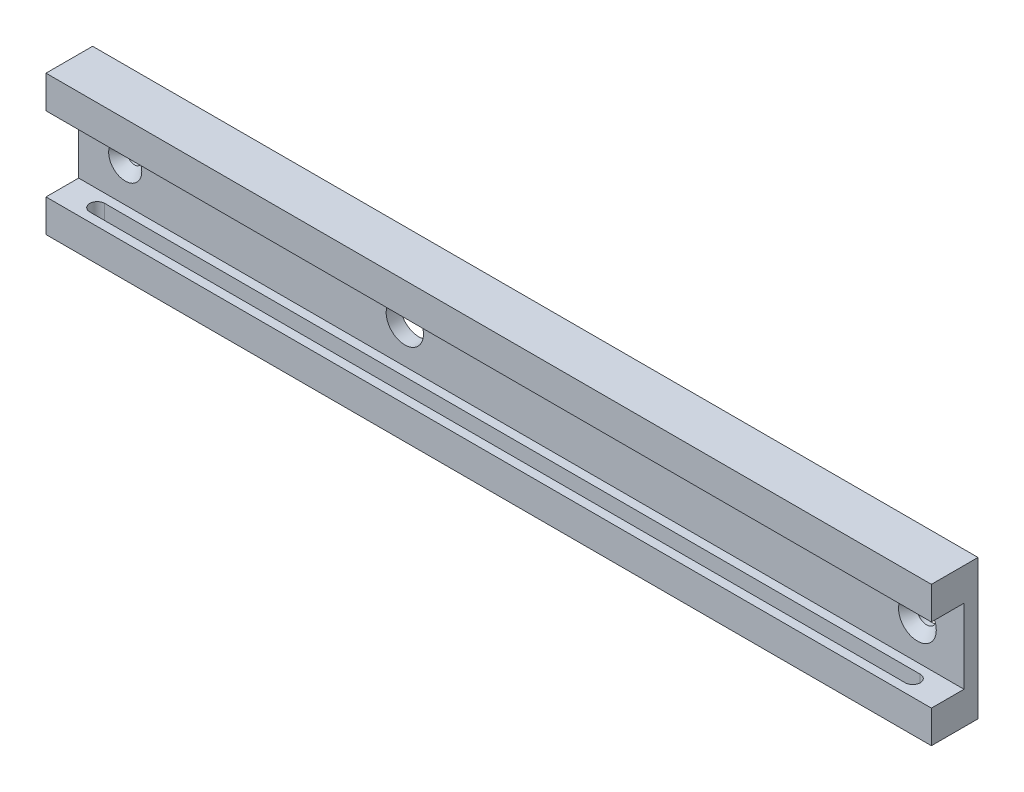
ISO-10303-21;
HEADER;
FILE_DESCRIPTION(('STEP AP214'),'2;1');
FILE_NAME('part.step','',(''),(''),'','','');
FILE_SCHEMA(('AUTOMOTIVE_DESIGN { 1 0 10303 214 1 1 1 1 }'));
ENDSEC;
DATA;
#1=APPLICATION_CONTEXT('core data for automotive mechanical design processes');
#2=APPLICATION_PROTOCOL_DEFINITION('international standard','automotive_design',2000,#1);
#3=PRODUCT_CONTEXT('',#1,'mechanical');
#4=PRODUCT('Part','Part','',(#3));
#5=PRODUCT_RELATED_PRODUCT_CATEGORY('part','',(#4));
#6=PRODUCT_DEFINITION_FORMATION('','',#4);
#7=PRODUCT_DEFINITION_CONTEXT('part definition',#1,'design');
#8=PRODUCT_DEFINITION('design','',#6,#7);
#9=PRODUCT_DEFINITION_SHAPE('','',#8);
#10=(LENGTH_UNIT() NAMED_UNIT(*) SI_UNIT(.MILLI.,.METRE.));
#11=(NAMED_UNIT(*) PLANE_ANGLE_UNIT() SI_UNIT($,.RADIAN.));
#12=(NAMED_UNIT(*) SI_UNIT($,.STERADIAN.) SOLID_ANGLE_UNIT());
#13=UNCERTAINTY_MEASURE_WITH_UNIT(LENGTH_MEASURE(1.E-05),#10,'distance_accuracy_value','');
#14=(GEOMETRIC_REPRESENTATION_CONTEXT(3) GLOBAL_UNCERTAINTY_ASSIGNED_CONTEXT((#13)) GLOBAL_UNIT_ASSIGNED_CONTEXT((#10,
#11,#12)) REPRESENTATION_CONTEXT('',''));
#15=CARTESIAN_POINT('',(0.,0.,0.));
#16=DIRECTION('',(0.,0.,1.));
#17=DIRECTION('',(1.,0.,0.));
#18=AXIS2_PLACEMENT_3D('',#15,#16,#17);
#19=CARTESIAN_POINT('',(0.,0.,10.));
#20=DIRECTION('',(0.,0.,-1.));
#21=DIRECTION('',(-1.,0.,0.));
#22=AXIS2_PLACEMENT_3D('',#19,#20,#21);
#23=PLANE('',#22);
#24=DIRECTION('',(0.,-1.,0.));
#25=VECTOR('',#24,1.);
#26=CARTESIAN_POINT('',(0.,0.,10.));
#27=LINE('',#26,#25);
#28=CARTESIAN_POINT('',(0.,30.,10.));
#29=VERTEX_POINT('',#28);
#30=CARTESIAN_POINT('',(0.,23.,10.));
#31=VERTEX_POINT('',#30);
#32=EDGE_CURVE('E181',#29,#31,#27,.T.);
#33=ORIENTED_EDGE('',*,*,#32,.T.);
#34=DIRECTION('',(1.,0.,0.));
#35=VECTOR('',#34,1.);
#36=CARTESIAN_POINT('',(0.,23.,10.));
#37=LINE('',#36,#35);
#38=CARTESIAN_POINT('',(190.,23.,10.));
#39=VERTEX_POINT('',#38);
#40=EDGE_CURVE('E172',#31,#39,#37,.T.);
#41=ORIENTED_EDGE('',*,*,#40,.T.);
#42=DIRECTION('',(0.,1.,0.));
#43=VECTOR('',#42,1.);
#44=CARTESIAN_POINT('',(190.,0.,10.));
#45=LINE('',#44,#43);
#46=CARTESIAN_POINT('',(190.,30.,10.));
#47=VERTEX_POINT('',#46);
#48=EDGE_CURVE('E187',#39,#47,#45,.T.);
#49=ORIENTED_EDGE('',*,*,#48,.T.);
#50=DIRECTION('',(-1.,0.,0.));
#51=VECTOR('',#50,1.);
#52=CARTESIAN_POINT('',(0.,30.,10.));
#53=LINE('',#52,#51);
#54=EDGE_CURVE('E191',#47,#29,#53,.T.);
#55=ORIENTED_EDGE('',*,*,#54,.T.);
#56=EDGE_LOOP('',(#33,#41,#49,#55));
#57=FACE_BOUND('',#56,.T.);
#58=ADVANCED_FACE('F37',(#57),#23,.F.);
#59=CARTESIAN_POINT('',(0.,0.,10.));
#60=DIRECTION('',(1.,0.,0.));
#61=DIRECTION('',(0.,0.,-1.));
#62=AXIS2_PLACEMENT_3D('',#59,#60,#61);
#63=PLANE('',#62);
#64=DIRECTION('',(0.,1.,0.));
#65=VECTOR('',#64,1.);
#66=CARTESIAN_POINT('',(0.,7.,3.));
#67=LINE('',#66,#65);
#68=CARTESIAN_POINT('',(0.,7.,3.));
#69=VERTEX_POINT('',#68);
#70=CARTESIAN_POINT('',(0.,23.,3.));
#71=VERTEX_POINT('',#70);
#72=EDGE_CURVE('E158',#69,#71,#67,.T.);
#73=ORIENTED_EDGE('',*,*,#72,.T.);
#74=DIRECTION('',(0.,0.,1.));
#75=VECTOR('',#74,1.);
#76=CARTESIAN_POINT('',(0.,23.,10.));
#77=LINE('',#76,#75);
#78=EDGE_CURVE('E162',#71,#31,#77,.T.);
#79=ORIENTED_EDGE('',*,*,#78,.T.);
#80=ORIENTED_EDGE('',*,*,#32,.F.);
#81=DIRECTION('',(0.,0.,-1.));
#82=VECTOR('',#81,1.);
#83=CARTESIAN_POINT('',(0.,30.,10.));
#84=LINE('',#83,#82);
#85=CARTESIAN_POINT('',(0.,30.,0.));
#86=VERTEX_POINT('',#85);
#87=EDGE_CURVE('E193',#29,#86,#84,.T.);
#88=ORIENTED_EDGE('',*,*,#87,.T.);
#89=DIRECTION('',(0.,-1.,0.));
#90=VECTOR('',#89,1.);
#91=CARTESIAN_POINT('',(0.,0.,0.));
#92=LINE('',#91,#90);
#93=CARTESIAN_POINT('',(0.,0.,0.));
#94=VERTEX_POINT('',#93);
#95=EDGE_CURVE('E175',#86,#94,#92,.T.);
#96=ORIENTED_EDGE('',*,*,#95,.T.);
#97=DIRECTION('',(0.,0.,-1.));
#98=VECTOR('',#97,1.);
#99=CARTESIAN_POINT('',(0.,0.,10.));
#100=LINE('',#99,#98);
#101=CARTESIAN_POINT('',(0.,0.,10.));
#102=VERTEX_POINT('',#101);
#103=EDGE_CURVE('E210',#102,#94,#100,.T.);
#104=ORIENTED_EDGE('',*,*,#103,.F.);
#105=CARTESIAN_POINT('',(0.,7.,10.));
#106=VERTEX_POINT('',#105);
#107=EDGE_CURVE('E185',#106,#102,#27,.T.);
#108=ORIENTED_EDGE('',*,*,#107,.F.);
#109=DIRECTION('',(0.,0.,-1.));
#110=VECTOR('',#109,1.);
#111=CARTESIAN_POINT('',(0.,7.,10.));
#112=LINE('',#111,#110);
#113=EDGE_CURVE('E155',#106,#69,#112,.T.);
#114=ORIENTED_EDGE('',*,*,#113,.T.);
#115=EDGE_LOOP('',(#73,#79,#80,#88,#96,#104,#108,#114));
#116=FACE_BOUND('',#115,.T.);
#117=ADVANCED_FACE('F234',(#116),#63,.F.);
#118=CARTESIAN_POINT('',(0.,0.,10.));
#119=DIRECTION('',(0.,1.,0.));
#120=DIRECTION('',(0.,0.,1.));
#121=AXIS2_PLACEMENT_3D('',#118,#119,#120);
#122=PLANE('',#121);
#123=CARTESIAN_POINT('',(182.5,0.,6.50000000000001));
#124=DIRECTION('',(0.,-1.,0.));
#125=DIRECTION('',(0.,0.,-1.));
#126=AXIS2_PLACEMENT_3D('',#123,#124,#125);
#127=CIRCLE('',#126,1.6);
#128=CARTESIAN_POINT('',(182.5,0.,4.90000000000001));
#129=VERTEX_POINT('',#128);
#130=CARTESIAN_POINT('',(182.5,0.,8.10000000000001));
#131=VERTEX_POINT('',#130);
#132=EDGE_CURVE('E334',#129,#131,#127,.T.);
#133=ORIENTED_EDGE('',*,*,#132,.F.);
#134=DIRECTION('',(1.,0.,0.));
#135=VECTOR('',#134,1.);
#136=CARTESIAN_POINT('',(7.50000000000002,0.,4.9));
#137=LINE('',#136,#135);
#138=CARTESIAN_POINT('',(7.50000000000002,0.,4.9));
#139=VERTEX_POINT('',#138);
#140=EDGE_CURVE('E337',#139,#129,#137,.T.);
#141=ORIENTED_EDGE('',*,*,#140,.F.);
#142=CARTESIAN_POINT('',(7.50000000000002,0.,6.5));
#143=DIRECTION('',(0.,-1.,0.));
#144=DIRECTION('',(0.,0.,-1.));
#145=AXIS2_PLACEMENT_3D('',#142,#143,#144);
#146=CIRCLE('',#145,1.6);
#147=CARTESIAN_POINT('',(7.50000000000002,0.,8.1));
#148=VERTEX_POINT('',#147);
#149=EDGE_CURVE('E146',#148,#139,#146,.T.);
#150=ORIENTED_EDGE('',*,*,#149,.F.);
#151=DIRECTION('',(-1.,0.,0.));
#152=VECTOR('',#151,1.);
#153=CARTESIAN_POINT('',(7.50000000000002,0.,8.1));
#154=LINE('',#153,#152);
#155=EDGE_CURVE('E52',#131,#148,#154,.T.);
#156=ORIENTED_EDGE('',*,*,#155,.F.);
#157=EDGE_LOOP('',(#133,#141,#150,#156));
#158=FACE_BOUND('',#157,.T.);
#159=DIRECTION('',(1.,0.,0.));
#160=VECTOR('',#159,1.);
#161=CARTESIAN_POINT('',(0.,0.,0.));
#162=LINE('',#161,#160);
#163=CARTESIAN_POINT('',(190.,0.,0.));
#164=VERTEX_POINT('',#163);
#165=EDGE_CURVE('E196',#94,#164,#162,.T.);
#166=ORIENTED_EDGE('',*,*,#165,.T.);
#167=DIRECTION('',(0.,0.,-1.));
#168=VECTOR('',#167,1.);
#169=CARTESIAN_POINT('',(190.,0.,10.));
#170=LINE('',#169,#168);
#171=CARTESIAN_POINT('',(190.,0.,10.));
#172=VERTEX_POINT('',#171);
#173=EDGE_CURVE('E207',#172,#164,#170,.T.);
#174=ORIENTED_EDGE('',*,*,#173,.F.);
#175=DIRECTION('',(1.,0.,0.));
#176=VECTOR('',#175,1.);
#177=CARTESIAN_POINT('',(0.,0.,10.));
#178=LINE('',#177,#176);
#179=EDGE_CURVE('E184',#102,#172,#178,.T.);
#180=ORIENTED_EDGE('',*,*,#179,.F.);
#181=ORIENTED_EDGE('',*,*,#103,.T.);
#182=EDGE_LOOP('',(#166,#174,#180,#181));
#183=FACE_BOUND('',#182,.T.);
#184=ADVANCED_FACE('F241',(#158,#183),#122,.F.);
#185=CARTESIAN_POINT('',(190.,0.,10.));
#186=DIRECTION('',(-1.,0.,0.));
#187=DIRECTION('',(0.,0.,1.));
#188=AXIS2_PLACEMENT_3D('',#185,#186,#187);
#189=PLANE('',#188);
#190=ORIENTED_EDGE('',*,*,#48,.F.);
#191=DIRECTION('',(0.,0.,1.));
#192=VECTOR('',#191,1.);
#193=CARTESIAN_POINT('',(190.,23.,10.));
#194=LINE('',#193,#192);
#195=CARTESIAN_POINT('',(190.,23.,3.));
#196=VERTEX_POINT('',#195);
#197=EDGE_CURVE('E159',#196,#39,#194,.T.);
#198=ORIENTED_EDGE('',*,*,#197,.F.);
#199=DIRECTION('',(0.,1.,0.));
#200=VECTOR('',#199,1.);
#201=CARTESIAN_POINT('',(190.,7.,3.));
#202=LINE('',#201,#200);
#203=CARTESIAN_POINT('',(190.,7.,3.));
#204=VERTEX_POINT('',#203);
#205=EDGE_CURVE('E168',#204,#196,#202,.T.);
#206=ORIENTED_EDGE('',*,*,#205,.F.);
#207=DIRECTION('',(0.,0.,-1.));
#208=VECTOR('',#207,1.);
#209=CARTESIAN_POINT('',(190.,7.,10.));
#210=LINE('',#209,#208);
#211=CARTESIAN_POINT('',(190.,7.,10.));
#212=VERTEX_POINT('',#211);
#213=EDGE_CURVE('E154',#212,#204,#210,.T.);
#214=ORIENTED_EDGE('',*,*,#213,.F.);
#215=EDGE_CURVE('E188',#172,#212,#45,.T.);
#216=ORIENTED_EDGE('',*,*,#215,.F.);
#217=ORIENTED_EDGE('',*,*,#173,.T.);
#218=DIRECTION('',(0.,1.,0.));
#219=VECTOR('',#218,1.);
#220=CARTESIAN_POINT('',(190.,0.,0.));
#221=LINE('',#220,#219);
#222=CARTESIAN_POINT('',(190.,30.,0.));
#223=VERTEX_POINT('',#222);
#224=EDGE_CURVE('E198',#164,#223,#221,.T.);
#225=ORIENTED_EDGE('',*,*,#224,.T.);
#226=DIRECTION('',(0.,0.,-1.));
#227=VECTOR('',#226,1.);
#228=CARTESIAN_POINT('',(190.,30.,10.));
#229=LINE('',#228,#227);
#230=EDGE_CURVE('E204',#47,#223,#229,.T.);
#231=ORIENTED_EDGE('',*,*,#230,.F.);
#232=EDGE_LOOP('',(#190,#198,#206,#214,#216,#217,#225,#231));
#233=FACE_BOUND('',#232,.T.);
#234=ADVANCED_FACE('F256',(#233),#189,.F.);
#235=CARTESIAN_POINT('',(0.,30.,10.));
#236=DIRECTION('',(0.,-1.,0.));
#237=DIRECTION('',(0.,0.,-1.));
#238=AXIS2_PLACEMENT_3D('',#235,#236,#237);
#239=PLANE('',#238);
#240=DIRECTION('',(-1.,0.,0.));
#241=VECTOR('',#240,1.);
#242=CARTESIAN_POINT('',(0.,30.,0.));
#243=LINE('',#242,#241);
#244=EDGE_CURVE('E200',#223,#86,#243,.T.);
#245=ORIENTED_EDGE('',*,*,#244,.T.);
#246=ORIENTED_EDGE('',*,*,#87,.F.);
#247=ORIENTED_EDGE('',*,*,#54,.F.);
#248=ORIENTED_EDGE('',*,*,#230,.T.);
#249=EDGE_LOOP('',(#245,#246,#247,#248));
#250=FACE_BOUND('',#249,.T.);
#251=ADVANCED_FACE('F248',(#250),#239,.F.);
#252=ORIENTED_EDGE('',*,*,#215,.T.);
#253=DIRECTION('',(1.,0.,0.));
#254=VECTOR('',#253,1.);
#255=CARTESIAN_POINT('',(0.,7.,10.));
#256=LINE('',#255,#254);
#257=EDGE_CURVE('E165',#106,#212,#256,.T.);
#258=ORIENTED_EDGE('',*,*,#257,.F.);
#259=ORIENTED_EDGE('',*,*,#107,.T.);
#260=ORIENTED_EDGE('',*,*,#179,.T.);
#261=EDGE_LOOP('',(#252,#258,#259,#260));
#262=FACE_BOUND('',#261,.T.);
#263=ADVANCED_FACE('F237',(#262),#23,.F.);
#264=CARTESIAN_POINT('',(0.,0.,0.));
#265=DIRECTION('',(0.,0.,-1.));
#266=DIRECTION('',(-1.,0.,0.));
#267=AXIS2_PLACEMENT_3D('',#264,#265,#266);
#268=PLANE('',#267);
#269=CARTESIAN_POINT('',(70.,15.,0.));
#270=DIRECTION('',(0.,0.,1.));
#271=DIRECTION('',(1.,0.,0.));
#272=AXIS2_PLACEMENT_3D('',#269,#270,#271);
#273=CIRCLE('',#272,4.00000000000001);
#274=CARTESIAN_POINT('',(74.,15.,0.));
#275=VERTEX_POINT('',#274);
#276=EDGE_CURVE('E318',#275,#275,#273,.T.);
#277=ORIENTED_EDGE('',*,*,#276,.T.);
#278=EDGE_LOOP('',(#277));
#279=FACE_BOUND('',#278,.T.);
#280=CARTESIAN_POINT('',(10.,15.,0.));
#281=DIRECTION('',(0.,0.,1.));
#282=DIRECTION('',(1.,0.,0.));
#283=AXIS2_PLACEMENT_3D('',#280,#281,#282);
#284=CIRCLE('',#283,1.55);
#285=CARTESIAN_POINT('',(11.55,15.,0.));
#286=VERTEX_POINT('',#285);
#287=EDGE_CURVE('E324',#286,#286,#284,.T.);
#288=ORIENTED_EDGE('',*,*,#287,.T.);
#289=EDGE_LOOP('',(#288));
#290=FACE_BOUND('',#289,.T.);
#291=CARTESIAN_POINT('',(180.,15.,0.));
#292=DIRECTION('',(0.,0.,1.));
#293=DIRECTION('',(1.,0.,0.));
#294=AXIS2_PLACEMENT_3D('',#291,#292,#293);
#295=CIRCLE('',#294,2.04999999999999);
#296=CARTESIAN_POINT('',(182.05,15.,0.));
#297=VERTEX_POINT('',#296);
#298=EDGE_CURVE('E329',#297,#297,#295,.T.);
#299=ORIENTED_EDGE('',*,*,#298,.T.);
#300=EDGE_LOOP('',(#299));
#301=FACE_BOUND('',#300,.T.);
#302=ORIENTED_EDGE('',*,*,#95,.F.);
#303=ORIENTED_EDGE('',*,*,#244,.F.);
#304=ORIENTED_EDGE('',*,*,#224,.F.);
#305=ORIENTED_EDGE('',*,*,#165,.F.);
#306=EDGE_LOOP('',(#302,#303,#304,#305));
#307=FACE_BOUND('',#306,.T.);
#308=ADVANCED_FACE('F247',(#279,#290,#301,#307),#268,.T.);
#309=CARTESIAN_POINT('',(0.,23.,10.));
#310=DIRECTION('',(0.,1.,0.));
#311=DIRECTION('',(0.,0.,1.));
#312=AXIS2_PLACEMENT_3D('',#309,#310,#311);
#313=PLANE('',#312);
#314=ORIENTED_EDGE('',*,*,#197,.T.);
#315=ORIENTED_EDGE('',*,*,#40,.F.);
#316=ORIENTED_EDGE('',*,*,#78,.F.);
#317=DIRECTION('',(1.,0.,0.));
#318=VECTOR('',#317,1.);
#319=CARTESIAN_POINT('',(0.,23.,3.));
#320=LINE('',#319,#318);
#321=EDGE_CURVE('E176',#71,#196,#320,.T.);
#322=ORIENTED_EDGE('',*,*,#321,.T.);
#323=EDGE_LOOP('',(#314,#315,#316,#322));
#324=FACE_BOUND('',#323,.T.);
#325=ADVANCED_FACE('F254',(#324),#313,.F.);
#326=CARTESIAN_POINT('',(0.,7.,3.));
#327=DIRECTION('',(0.,0.,-1.));
#328=DIRECTION('',(0.,1.,0.));
#329=AXIS2_PLACEMENT_3D('',#326,#327,#328);
#330=PLANE('',#329);
#331=CARTESIAN_POINT('',(10.,15.,3.));
#332=DIRECTION('',(0.,0.,-1.));
#333=DIRECTION('',(0.,1.,0.));
#334=AXIS2_PLACEMENT_3D('',#331,#332,#333);
#335=CIRCLE('',#334,3.54999999999997);
#336=CARTESIAN_POINT('',(10.,18.55,3.));
#337=VERTEX_POINT('',#336);
#338=EDGE_CURVE('E11',#337,#337,#335,.T.);
#339=ORIENTED_EDGE('',*,*,#338,.T.);
#340=EDGE_LOOP('',(#339));
#341=FACE_BOUND('',#340,.T.);
#342=CARTESIAN_POINT('',(180.,15.,3.));
#343=DIRECTION('',(0.,0.,-1.));
#344=DIRECTION('',(0.,1.,0.));
#345=AXIS2_PLACEMENT_3D('',#342,#343,#344);
#346=CIRCLE('',#345,4.04999999999997);
#347=CARTESIAN_POINT('',(180.,19.05,3.));
#348=VERTEX_POINT('',#347);
#349=EDGE_CURVE('E216',#348,#348,#346,.T.);
#350=ORIENTED_EDGE('',*,*,#349,.T.);
#351=EDGE_LOOP('',(#350));
#352=FACE_BOUND('',#351,.T.);
#353=CARTESIAN_POINT('',(70.,15.,3.));
#354=DIRECTION('',(0.,0.,1.));
#355=DIRECTION('',(1.,0.,0.));
#356=AXIS2_PLACEMENT_3D('',#353,#354,#355);
#357=CIRCLE('',#356,4.00000000000001);
#358=CARTESIAN_POINT('',(74.,15.,3.));
#359=VERTEX_POINT('',#358);
#360=EDGE_CURVE('E321',#359,#359,#357,.T.);
#361=ORIENTED_EDGE('',*,*,#360,.F.);
#362=EDGE_LOOP('',(#361));
#363=FACE_BOUND('',#362,.T.);
#364=ORIENTED_EDGE('',*,*,#205,.T.);
#365=ORIENTED_EDGE('',*,*,#321,.F.);
#366=ORIENTED_EDGE('',*,*,#72,.F.);
#367=DIRECTION('',(1.,0.,0.));
#368=VECTOR('',#367,1.);
#369=CARTESIAN_POINT('',(0.,7.,3.));
#370=LINE('',#369,#368);
#371=EDGE_CURVE('E178',#69,#204,#370,.T.);
#372=ORIENTED_EDGE('',*,*,#371,.T.);
#373=EDGE_LOOP('',(#364,#365,#366,#372));
#374=FACE_BOUND('',#373,.T.);
#375=ADVANCED_FACE('F283',(#341,#352,#363,#374),#330,.F.);
#376=CARTESIAN_POINT('',(0.,7.,10.));
#377=DIRECTION('',(0.,-1.,0.));
#378=DIRECTION('',(0.,0.,-1.));
#379=AXIS2_PLACEMENT_3D('',#376,#377,#378);
#380=PLANE('',#379);
#381=CARTESIAN_POINT('',(7.50000000000002,7.,6.5));
#382=DIRECTION('',(0.,-1.,0.));
#383=DIRECTION('',(0.,0.,-1.));
#384=AXIS2_PLACEMENT_3D('',#381,#382,#383);
#385=CIRCLE('',#384,1.6);
#386=CARTESIAN_POINT('',(7.50000000000002,7.,4.9));
#387=VERTEX_POINT('',#386);
#388=CARTESIAN_POINT('',(7.50000000000002,7.,8.1));
#389=VERTEX_POINT('',#388);
#390=EDGE_CURVE('E137',#387,#389,#385,.F.);
#391=ORIENTED_EDGE('',*,*,#390,.F.);
#392=DIRECTION('',(-1.,0.,0.));
#393=VECTOR('',#392,1.);
#394=CARTESIAN_POINT('',(7.50000000000002,7.,4.9));
#395=LINE('',#394,#393);
#396=CARTESIAN_POINT('',(182.5,7.,4.90000000000001));
#397=VERTEX_POINT('',#396);
#398=EDGE_CURVE('E60',#397,#387,#395,.T.);
#399=ORIENTED_EDGE('',*,*,#398,.F.);
#400=CARTESIAN_POINT('',(182.5,7.,6.50000000000001));
#401=DIRECTION('',(0.,-1.,0.));
#402=DIRECTION('',(0.,0.,-1.));
#403=AXIS2_PLACEMENT_3D('',#400,#401,#402);
#404=CIRCLE('',#403,1.6);
#405=CARTESIAN_POINT('',(182.5,7.,8.10000000000001));
#406=VERTEX_POINT('',#405);
#407=EDGE_CURVE('E144',#406,#397,#404,.F.);
#408=ORIENTED_EDGE('',*,*,#407,.F.);
#409=DIRECTION('',(1.,0.,0.));
#410=VECTOR('',#409,1.);
#411=CARTESIAN_POINT('',(7.50000000000002,7.,8.1));
#412=LINE('',#411,#410);
#413=EDGE_CURVE('E128',#389,#406,#412,.T.);
#414=ORIENTED_EDGE('',*,*,#413,.F.);
#415=EDGE_LOOP('',(#391,#399,#408,#414));
#416=FACE_BOUND('',#415,.T.);
#417=ORIENTED_EDGE('',*,*,#213,.T.);
#418=ORIENTED_EDGE('',*,*,#371,.F.);
#419=ORIENTED_EDGE('',*,*,#113,.F.);
#420=ORIENTED_EDGE('',*,*,#257,.T.);
#421=EDGE_LOOP('',(#417,#418,#419,#420));
#422=FACE_BOUND('',#421,.T.);
#423=ADVANCED_FACE('F141',(#416,#422),#380,.F.);
#424=CARTESIAN_POINT('',(7.50000000000002,30.001,4.9));
#425=DIRECTION('',(0.,0.,-1.));
#426=DIRECTION('',(-1.,0.,0.));
#427=AXIS2_PLACEMENT_3D('',#424,#425,#426);
#428=PLANE('',#427);
#429=ORIENTED_EDGE('',*,*,#398,.T.);
#430=DIRECTION('',(0.,-1.,0.));
#431=VECTOR('',#430,1.);
#432=CARTESIAN_POINT('',(7.50000000000002,30.001,4.9));
#433=LINE('',#432,#431);
#434=EDGE_CURVE('E133',#387,#139,#433,.T.);
#435=ORIENTED_EDGE('',*,*,#434,.T.);
#436=ORIENTED_EDGE('',*,*,#140,.T.);
#437=DIRECTION('',(0.,-1.,0.));
#438=VECTOR('',#437,1.);
#439=CARTESIAN_POINT('',(182.5,30.001,4.90000000000001));
#440=LINE('',#439,#438);
#441=EDGE_CURVE('E151',#397,#129,#440,.T.);
#442=ORIENTED_EDGE('',*,*,#441,.F.);
#443=EDGE_LOOP('',(#429,#435,#436,#442));
#444=FACE_BOUND('',#443,.T.);
#445=ADVANCED_FACE('F291',(#444),#428,.F.);
#446=CARTESIAN_POINT('',(182.5,30.001,6.50000000000001));
#447=DIRECTION('',(0.,-1.,0.));
#448=DIRECTION('',(0.,0.,-1.));
#449=AXIS2_PLACEMENT_3D('',#446,#447,#448);
#450=CYLINDRICAL_SURFACE('',#449,1.6);
#451=ORIENTED_EDGE('',*,*,#407,.T.);
#452=ORIENTED_EDGE('',*,*,#441,.T.);
#453=ORIENTED_EDGE('',*,*,#132,.T.);
#454=DIRECTION('',(0.,-1.,0.));
#455=VECTOR('',#454,1.);
#456=CARTESIAN_POINT('',(182.5,30.001,8.10000000000001));
#457=LINE('',#456,#455);
#458=EDGE_CURVE('E134',#406,#131,#457,.T.);
#459=ORIENTED_EDGE('',*,*,#458,.F.);
#460=EDGE_LOOP('',(#451,#452,#453,#459));
#461=FACE_BOUND('',#460,.T.);
#462=ADVANCED_FACE('F297',(#461),#450,.F.);
#463=CARTESIAN_POINT('',(7.50000000000002,30.001,8.1));
#464=DIRECTION('',(0.,0.,1.));
#465=DIRECTION('',(1.,0.,0.));
#466=AXIS2_PLACEMENT_3D('',#463,#464,#465);
#467=PLANE('',#466);
#468=ORIENTED_EDGE('',*,*,#413,.T.);
#469=ORIENTED_EDGE('',*,*,#458,.T.);
#470=ORIENTED_EDGE('',*,*,#155,.T.);
#471=DIRECTION('',(0.,-1.,0.));
#472=VECTOR('',#471,1.);
#473=CARTESIAN_POINT('',(7.50000000000002,30.001,8.1));
#474=LINE('',#473,#472);
#475=EDGE_CURVE('E124',#389,#148,#474,.T.);
#476=ORIENTED_EDGE('',*,*,#475,.F.);
#477=EDGE_LOOP('',(#468,#469,#470,#476));
#478=FACE_BOUND('',#477,.T.);
#479=ADVANCED_FACE('F126',(#478),#467,.F.);
#480=CARTESIAN_POINT('',(7.50000000000002,30.001,6.5));
#481=DIRECTION('',(0.,-1.,0.));
#482=DIRECTION('',(0.,0.,-1.));
#483=AXIS2_PLACEMENT_3D('',#480,#481,#482);
#484=CYLINDRICAL_SURFACE('',#483,1.6);
#485=ORIENTED_EDGE('',*,*,#390,.T.);
#486=ORIENTED_EDGE('',*,*,#475,.T.);
#487=ORIENTED_EDGE('',*,*,#149,.T.);
#488=ORIENTED_EDGE('',*,*,#434,.F.);
#489=EDGE_LOOP('',(#485,#486,#487,#488));
#490=FACE_BOUND('',#489,.T.);
#491=ADVANCED_FACE('F138',(#490),#484,.F.);
#492=CARTESIAN_POINT('',(180.,15.,0.));
#493=DIRECTION('',(0.,0.,1.));
#494=DIRECTION('',(1.,0.,0.));
#495=AXIS2_PLACEMENT_3D('',#492,#493,#494);
#496=CYLINDRICAL_SURFACE('',#495,2.04999999999999);
#497=CARTESIAN_POINT('',(180.,15.,1.00000000000002));
#498=DIRECTION('',(0.,0.,-1.));
#499=DIRECTION('',(-1.,0.,0.));
#500=AXIS2_PLACEMENT_3D('',#497,#498,#499);
#501=CIRCLE('',#500,2.04999999999999);
#502=CARTESIAN_POINT('',(177.95,15.,1.00000000000002));
#503=VERTEX_POINT('',#502);
#504=EDGE_CURVE('E213',#503,#503,#501,.F.);
#505=ORIENTED_EDGE('',*,*,#504,.T.);
#506=EDGE_LOOP('',(#505));
#507=FACE_BOUND('',#506,.T.);
#508=ORIENTED_EDGE('',*,*,#298,.F.);
#509=EDGE_LOOP('',(#508));
#510=FACE_BOUND('',#509,.T.);
#511=ADVANCED_FACE('F305',(#507,#510),#496,.F.);
#512=CARTESIAN_POINT('',(10.,15.,0.));
#513=DIRECTION('',(0.,0.,1.));
#514=DIRECTION('',(1.,0.,0.));
#515=AXIS2_PLACEMENT_3D('',#512,#513,#514);
#516=CYLINDRICAL_SURFACE('',#515,1.55);
#517=CARTESIAN_POINT('',(10.,15.,1.00000000000002));
#518=DIRECTION('',(0.,0.,-1.));
#519=DIRECTION('',(-1.,0.,0.));
#520=AXIS2_PLACEMENT_3D('',#517,#518,#519);
#521=CIRCLE('',#520,1.55);
#522=CARTESIAN_POINT('',(8.45000000000001,15.,1.00000000000002));
#523=VERTEX_POINT('',#522);
#524=EDGE_CURVE('E45',#523,#523,#521,.F.);
#525=ORIENTED_EDGE('',*,*,#524,.T.);
#526=EDGE_LOOP('',(#525));
#527=FACE_BOUND('',#526,.T.);
#528=ORIENTED_EDGE('',*,*,#287,.F.);
#529=EDGE_LOOP('',(#528));
#530=FACE_BOUND('',#529,.T.);
#531=ADVANCED_FACE('F221',(#527,#530),#516,.F.);
#532=CARTESIAN_POINT('',(70.,15.,0.));
#533=DIRECTION('',(0.,0.,1.));
#534=DIRECTION('',(1.,0.,0.));
#535=AXIS2_PLACEMENT_3D('',#532,#533,#534);
#536=CYLINDRICAL_SURFACE('',#535,4.00000000000001);
#537=ORIENTED_EDGE('',*,*,#276,.F.);
#538=EDGE_LOOP('',(#537));
#539=FACE_BOUND('',#538,.T.);
#540=ORIENTED_EDGE('',*,*,#360,.T.);
#541=EDGE_LOOP('',(#540));
#542=FACE_BOUND('',#541,.T.);
#543=ADVANCED_FACE('F230',(#539,#542),#536,.F.);
#544=CARTESIAN_POINT('',(180.,15.,1.00000000000002));
#545=DIRECTION('',(0.,0.,1.));
#546=DIRECTION('',(1.,0.,0.));
#547=AXIS2_PLACEMENT_3D('',#544,#545,#546);
#548=CONICAL_SURFACE('',#547,2.04999999999999,0.785398163397447);
#549=ORIENTED_EDGE('',*,*,#349,.F.);
#550=EDGE_LOOP('',(#549));
#551=FACE_BOUND('',#550,.T.);
#552=ORIENTED_EDGE('',*,*,#504,.F.);
#553=EDGE_LOOP('',(#552));
#554=FACE_BOUND('',#553,.T.);
#555=ADVANCED_FACE('F225',(#551,#554),#548,.F.);
#556=CARTESIAN_POINT('',(10.,15.,1.00000000000002));
#557=DIRECTION('',(0.,0.,1.));
#558=DIRECTION('',(1.,0.,0.));
#559=AXIS2_PLACEMENT_3D('',#556,#557,#558);
#560=CONICAL_SURFACE('',#559,1.55,0.785398163397447);
#561=ORIENTED_EDGE('',*,*,#338,.F.);
#562=EDGE_LOOP('',(#561));
#563=FACE_BOUND('',#562,.T.);
#564=ORIENTED_EDGE('',*,*,#524,.F.);
#565=EDGE_LOOP('',(#564));
#566=FACE_BOUND('',#565,.T.);
#567=ADVANCED_FACE('F39',(#563,#566),#560,.F.);
#568=CLOSED_SHELL('',(#58,#117,#184,#234,#251,#263,#308,#325,#375,#423,#445,#462,#479,#491,#511,
#531,#543,#555,#567));
#569=MANIFOLD_SOLID_BREP('B2',#568);
#570=ADVANCED_BREP_SHAPE_REPRESENTATION('',(#18,#569),#14);
#571=SHAPE_DEFINITION_REPRESENTATION(#9,#570);
ENDSEC;
END-ISO-10303-21;
